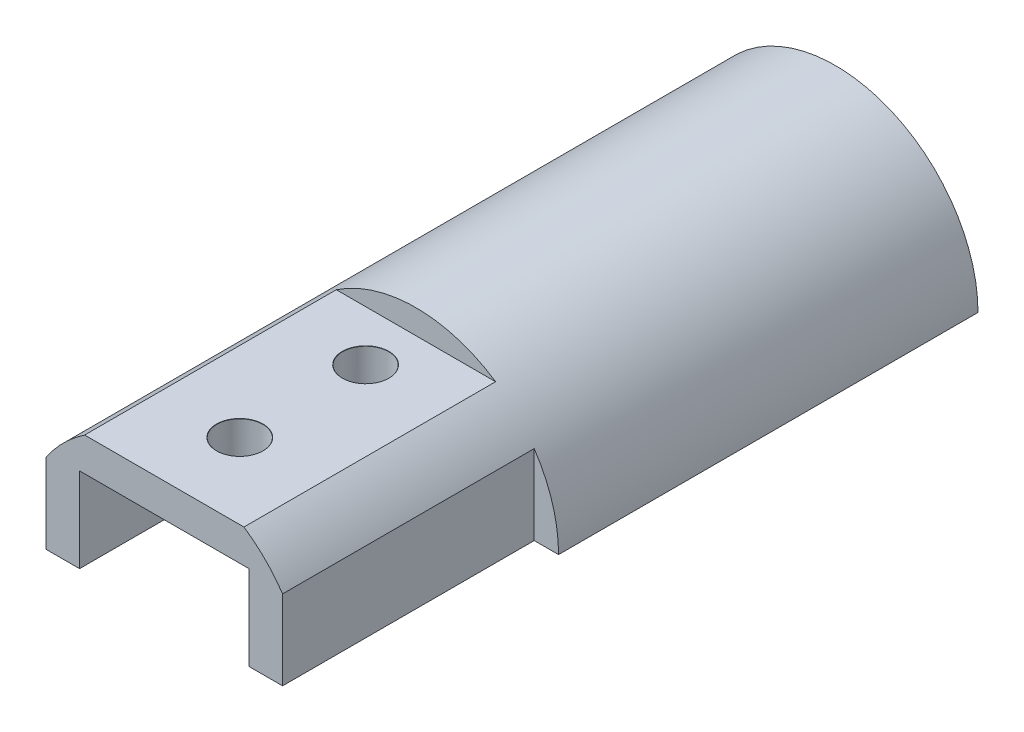
ISO-10303-21;
HEADER;
FILE_DESCRIPTION(('STEP AP214'),'2;1');
FILE_NAME('part.step','',(''),(''),'','','');
FILE_SCHEMA(('AUTOMOTIVE_DESIGN { 1 0 10303 214 1 1 1 1 }'));
ENDSEC;
DATA;
#1=APPLICATION_CONTEXT('core data for automotive mechanical design processes');
#2=APPLICATION_PROTOCOL_DEFINITION('international standard','automotive_design',2000,#1);
#3=PRODUCT_CONTEXT('',#1,'mechanical');
#4=PRODUCT('Part','Part','',(#3));
#5=PRODUCT_RELATED_PRODUCT_CATEGORY('part','',(#4));
#6=PRODUCT_DEFINITION_FORMATION('','',#4);
#7=PRODUCT_DEFINITION_CONTEXT('part definition',#1,'design');
#8=PRODUCT_DEFINITION('design','',#6,#7);
#9=PRODUCT_DEFINITION_SHAPE('','',#8);
#10=(LENGTH_UNIT() NAMED_UNIT(*) SI_UNIT(.MILLI.,.METRE.));
#11=(NAMED_UNIT(*) PLANE_ANGLE_UNIT() SI_UNIT($,.RADIAN.));
#12=(NAMED_UNIT(*) SI_UNIT($,.STERADIAN.) SOLID_ANGLE_UNIT());
#13=UNCERTAINTY_MEASURE_WITH_UNIT(LENGTH_MEASURE(1.E-05),#10,'distance_accuracy_value','');
#14=(GEOMETRIC_REPRESENTATION_CONTEXT(3) GLOBAL_UNCERTAINTY_ASSIGNED_CONTEXT((#13)) GLOBAL_UNIT_ASSIGNED_CONTEXT((#10,
#11,#12)) REPRESENTATION_CONTEXT('',''));
#15=CARTESIAN_POINT('',(0.,0.,0.));
#16=DIRECTION('',(0.,0.,1.));
#17=DIRECTION('',(1.,0.,0.));
#18=AXIS2_PLACEMENT_3D('',#15,#16,#17);
#19=CARTESIAN_POINT('',(0.,0.,50.));
#20=DIRECTION('',(0.,0.,1.));
#21=DIRECTION('',(1.,0.,0.));
#22=AXIS2_PLACEMENT_3D('',#19,#20,#21);
#23=PLANE('',#22);
#24=CARTESIAN_POINT('',(0.,0.,50.));
#25=DIRECTION('',(0.,0.,1.));
#26=DIRECTION('',(1.,0.,0.));
#27=AXIS2_PLACEMENT_3D('',#24,#25,#26);
#28=CIRCLE('',#27,17.);
#29=CARTESIAN_POINT('',(-14.1,9.49684158023077,50.));
#30=VERTEX_POINT('',#29);
#31=CARTESIAN_POINT('',(-17.,0.,50.));
#32=VERTEX_POINT('',#31);
#33=EDGE_CURVE('E381',#30,#32,#28,.T.);
#34=ORIENTED_EDGE('',*,*,#33,.T.);
#35=DIRECTION('',(1.,0.,0.));
#36=VECTOR('',#35,1.);
#37=CARTESIAN_POINT('',(0.,0.,50.));
#38=LINE('',#37,#36);
#39=CARTESIAN_POINT('',(-14.1,0.,50.));
#40=VERTEX_POINT('',#39);
#41=EDGE_CURVE('E508',#32,#40,#38,.T.);
#42=ORIENTED_EDGE('',*,*,#41,.T.);
#43=DIRECTION('',(0.,-1.,0.));
#44=VECTOR('',#43,1.);
#45=CARTESIAN_POINT('',(-14.1,0.,50.));
#46=LINE('',#45,#44);
#47=EDGE_CURVE('E304',#30,#40,#46,.T.);
#48=ORIENTED_EDGE('',*,*,#47,.F.);
#49=EDGE_LOOP('',(#34,#42,#48));
#50=FACE_BOUND('',#49,.T.);
#51=ADVANCED_FACE('F43',(#50),#23,.T.);
#52=CARTESIAN_POINT('',(0.,0.,3.));
#53=DIRECTION('',(0.,0.,-1.));
#54=DIRECTION('',(-1.,0.,0.));
#55=AXIS2_PLACEMENT_3D('',#52,#53,#54);
#56=CYLINDRICAL_SURFACE('',#55,17.);
#57=DIRECTION('',(0.,0.,-1.));
#58=VECTOR('',#57,1.);
#59=CARTESIAN_POINT('',(-17.,0.,3.));
#60=LINE('',#59,#58);
#61=CARTESIAN_POINT('',(-17.,0.,0.));
#62=VERTEX_POINT('',#61);
#63=EDGE_CURVE('E527',#32,#62,#60,.T.);
#64=ORIENTED_EDGE('',*,*,#63,.F.);
#65=ORIENTED_EDGE('',*,*,#33,.F.);
#66=DIRECTION('',(0.,0.,-1.));
#67=VECTOR('',#66,1.);
#68=CARTESIAN_POINT('',(-14.1,9.49684158023077,80.));
#69=LINE('',#68,#67);
#70=CARTESIAN_POINT('',(-14.1,9.49684158023077,80.));
#71=VERTEX_POINT('',#70);
#72=EDGE_CURVE('E336',#71,#30,#69,.T.);
#73=ORIENTED_EDGE('',*,*,#72,.F.);
#74=CARTESIAN_POINT('',(0.,0.,80.));
#75=DIRECTION('',(0.,0.,1.));
#76=DIRECTION('',(1.,0.,0.));
#77=AXIS2_PLACEMENT_3D('',#74,#75,#76);
#78=CIRCLE('',#77,17.);
#79=CARTESIAN_POINT('',(-9.49684158023077,14.1,80.));
#80=VERTEX_POINT('',#79);
#81=EDGE_CURVE('E310',#80,#71,#78,.T.);
#82=ORIENTED_EDGE('',*,*,#81,.F.);
#83=DIRECTION('',(0.,0.,-1.));
#84=VECTOR('',#83,1.);
#85=CARTESIAN_POINT('',(-9.49684158023077,14.1,80.));
#86=LINE('',#85,#84);
#87=CARTESIAN_POINT('',(-9.49684158023077,14.1,50.));
#88=VERTEX_POINT('',#87);
#89=EDGE_CURVE('E338',#80,#88,#86,.T.);
#90=ORIENTED_EDGE('',*,*,#89,.T.);
#91=CARTESIAN_POINT('',(9.49684158023077,14.1,50.));
#92=VERTEX_POINT('',#91);
#93=EDGE_CURVE('E382',#92,#88,#28,.T.);
#94=ORIENTED_EDGE('',*,*,#93,.F.);
#95=DIRECTION('',(0.,0.,-1.));
#96=VECTOR('',#95,1.);
#97=CARTESIAN_POINT('',(9.49684158023077,14.1,80.));
#98=LINE('',#97,#96);
#99=CARTESIAN_POINT('',(9.49684158023077,14.1,80.));
#100=VERTEX_POINT('',#99);
#101=EDGE_CURVE('E341',#100,#92,#98,.T.);
#102=ORIENTED_EDGE('',*,*,#101,.F.);
#103=CARTESIAN_POINT('',(14.1,9.49684158023076,80.));
#104=VERTEX_POINT('',#103);
#105=EDGE_CURVE('E314',#104,#100,#78,.T.);
#106=ORIENTED_EDGE('',*,*,#105,.F.);
#107=DIRECTION('',(0.,0.,-1.));
#108=VECTOR('',#107,1.);
#109=CARTESIAN_POINT('',(14.1,9.49684158023076,80.));
#110=LINE('',#109,#108);
#111=CARTESIAN_POINT('',(14.1,9.49684158023076,50.));
#112=VERTEX_POINT('',#111);
#113=EDGE_CURVE('E343',#104,#112,#110,.T.);
#114=ORIENTED_EDGE('',*,*,#113,.T.);
#115=CARTESIAN_POINT('',(17.,0.,50.));
#116=VERTEX_POINT('',#115);
#117=EDGE_CURVE('E379',#116,#112,#28,.T.);
#118=ORIENTED_EDGE('',*,*,#117,.F.);
#119=DIRECTION('',(0.,0.,-1.));
#120=VECTOR('',#119,1.);
#121=CARTESIAN_POINT('',(17.,0.,3.));
#122=LINE('',#121,#120);
#123=CARTESIAN_POINT('',(17.,0.,0.));
#124=VERTEX_POINT('',#123);
#125=EDGE_CURVE('E513',#124,#116,#122,.F.);
#126=ORIENTED_EDGE('',*,*,#125,.F.);
#127=CARTESIAN_POINT('',(0.,0.,0.));
#128=DIRECTION('',(0.,0.,1.));
#129=DIRECTION('',(1.,0.,0.));
#130=AXIS2_PLACEMENT_3D('',#127,#128,#129);
#131=CIRCLE('',#130,17.);
#132=EDGE_CURVE('E386',#124,#62,#131,.T.);
#133=ORIENTED_EDGE('',*,*,#132,.T.);
#134=EDGE_LOOP('',(#64,#65,#73,#82,#90,#94,#102,#106,#114,#118,#126,#133));
#135=FACE_BOUND('',#134,.T.);
#136=ADVANCED_FACE('F45',(#135),#56,.T.);
#137=CARTESIAN_POINT('',(0.,0.,0.));
#138=DIRECTION('',(0.,0.,1.));
#139=DIRECTION('',(1.,0.,0.));
#140=AXIS2_PLACEMENT_3D('',#137,#138,#139);
#141=PLANE('',#140);
#142=CARTESIAN_POINT('',(7.77817459305212,7.77817459305193,0.));
#143=DIRECTION('',(0.,0.,1.));
#144=DIRECTION('',(1.,0.,0.));
#145=AXIS2_PLACEMENT_3D('',#142,#143,#144);
#146=CIRCLE('',#145,1.45);
#147=CARTESIAN_POINT('',(9.22817459305212,7.77817459305193,0.));
#148=VERTEX_POINT('',#147);
#149=EDGE_CURVE('E283',#148,#148,#146,.T.);
#150=ORIENTED_EDGE('',*,*,#149,.T.);
#151=EDGE_LOOP('',(#150));
#152=FACE_BOUND('',#151,.T.);
#153=CARTESIAN_POINT('',(1.15218884181823E-13,11.,0.));
#154=DIRECTION('',(0.,0.,1.));
#155=DIRECTION('',(1.,0.,0.));
#156=AXIS2_PLACEMENT_3D('',#153,#154,#155);
#157=CIRCLE('',#156,1.45);
#158=CARTESIAN_POINT('',(1.45000000000011,11.,0.));
#159=VERTEX_POINT('',#158);
#160=EDGE_CURVE('E274',#159,#159,#157,.T.);
#161=ORIENTED_EDGE('',*,*,#160,.T.);
#162=EDGE_LOOP('',(#161));
#163=FACE_BOUND('',#162,.T.);
#164=CARTESIAN_POINT('',(-7.77817459305195,7.77817459305209,0.));
#165=DIRECTION('',(0.,0.,1.));
#166=DIRECTION('',(1.,0.,0.));
#167=AXIS2_PLACEMENT_3D('',#164,#165,#166);
#168=CIRCLE('',#167,1.45);
#169=CARTESIAN_POINT('',(-6.32817459305196,7.77817459305209,0.));
#170=VERTEX_POINT('',#169);
#171=EDGE_CURVE('E265',#170,#170,#168,.T.);
#172=ORIENTED_EDGE('',*,*,#171,.T.);
#173=EDGE_LOOP('',(#172));
#174=FACE_BOUND('',#173,.T.);
#175=DIRECTION('',(1.,0.,0.));
#176=VECTOR('',#175,1.);
#177=CARTESIAN_POINT('',(0.,0.,0.));
#178=LINE('',#177,#176);
#179=CARTESIAN_POINT('',(-12.45,0.,0.));
#180=VERTEX_POINT('',#179);
#181=EDGE_CURVE('E525',#62,#180,#178,.T.);
#182=ORIENTED_EDGE('',*,*,#181,.F.);
#183=ORIENTED_EDGE('',*,*,#132,.F.);
#184=CARTESIAN_POINT('',(12.45,0.,0.));
#185=VERTEX_POINT('',#184);
#186=EDGE_CURVE('E514',#185,#124,#178,.T.);
#187=ORIENTED_EDGE('',*,*,#186,.F.);
#188=CARTESIAN_POINT('',(11.,0.,0.));
#189=DIRECTION('',(0.,0.,1.));
#190=DIRECTION('',(1.,0.,0.));
#191=AXIS2_PLACEMENT_3D('',#188,#189,#190);
#192=CIRCLE('',#191,1.45);
#193=CARTESIAN_POINT('',(9.55,0.,0.));
#194=VERTEX_POINT('',#193);
#195=EDGE_CURVE('E242',#185,#194,#192,.T.);
#196=ORIENTED_EDGE('',*,*,#195,.T.);
#197=CARTESIAN_POINT('',(5.,0.,0.));
#198=VERTEX_POINT('',#197);
#199=EDGE_CURVE('E234',#198,#194,#178,.T.);
#200=ORIENTED_EDGE('',*,*,#199,.F.);
#201=CARTESIAN_POINT('',(0.,0.,0.));
#202=DIRECTION('',(0.,0.,1.));
#203=DIRECTION('',(1.,0.,0.));
#204=AXIS2_PLACEMENT_3D('',#201,#202,#203);
#205=CIRCLE('',#204,5.);
#206=CARTESIAN_POINT('',(-5.,0.,0.));
#207=VERTEX_POINT('',#206);
#208=EDGE_CURVE('E383',#198,#207,#205,.T.);
#209=ORIENTED_EDGE('',*,*,#208,.T.);
#210=CARTESIAN_POINT('',(-9.55,0.,0.));
#211=VERTEX_POINT('',#210);
#212=EDGE_CURVE('E244',#211,#207,#178,.T.);
#213=ORIENTED_EDGE('',*,*,#212,.F.);
#214=CARTESIAN_POINT('',(-11.,0.,0.));
#215=DIRECTION('',(0.,0.,1.));
#216=DIRECTION('',(1.,0.,0.));
#217=AXIS2_PLACEMENT_3D('',#214,#215,#216);
#218=CIRCLE('',#217,1.45);
#219=EDGE_CURVE('E256',#211,#180,#218,.T.);
#220=ORIENTED_EDGE('',*,*,#219,.T.);
#221=EDGE_LOOP('',(#182,#183,#187,#196,#200,#209,#213,#220));
#222=FACE_BOUND('',#221,.T.);
#223=ADVANCED_FACE('F466',(#152,#163,#174,#222),#141,.F.);
#224=CARTESIAN_POINT('',(0.,0.,43.));
#225=DIRECTION('',(0.,0.,-1.));
#226=DIRECTION('',(-1.,0.,0.));
#227=AXIS2_PLACEMENT_3D('',#224,#225,#226);
#228=CYLINDRICAL_SURFACE('',#227,15.);
#229=CARTESIAN_POINT('',(0.,0.,43.));
#230=DIRECTION('',(0.,0.,1.));
#231=DIRECTION('',(1.,0.,0.));
#232=AXIS2_PLACEMENT_3D('',#229,#230,#231);
#233=CIRCLE('',#232,15.);
#234=CARTESIAN_POINT('',(15.,0.,43.));
#235=VERTEX_POINT('',#234);
#236=CARTESIAN_POINT('',(-15.,0.,43.));
#237=VERTEX_POINT('',#236);
#238=EDGE_CURVE('E388',#235,#237,#233,.T.);
#239=ORIENTED_EDGE('',*,*,#238,.T.);
#240=DIRECTION('',(0.,0.,-1.));
#241=VECTOR('',#240,1.);
#242=CARTESIAN_POINT('',(-15.,0.,43.));
#243=LINE('',#242,#241);
#244=CARTESIAN_POINT('',(-15.,0.,3.));
#245=VERTEX_POINT('',#244);
#246=EDGE_CURVE('E528',#237,#245,#243,.T.);
#247=ORIENTED_EDGE('',*,*,#246,.T.);
#248=CARTESIAN_POINT('',(0.,0.,3.));
#249=DIRECTION('',(0.,0.,1.));
#250=DIRECTION('',(1.,0.,0.));
#251=AXIS2_PLACEMENT_3D('',#248,#249,#250);
#252=CIRCLE('',#251,15.);
#253=CARTESIAN_POINT('',(15.,0.,3.));
#254=VERTEX_POINT('',#253);
#255=EDGE_CURVE('E393',#245,#254,#252,.F.);
#256=ORIENTED_EDGE('',*,*,#255,.T.);
#257=DIRECTION('',(0.,0.,-1.));
#258=VECTOR('',#257,1.);
#259=CARTESIAN_POINT('',(15.,0.,43.));
#260=LINE('',#259,#258);
#261=EDGE_CURVE('E517',#254,#235,#260,.F.);
#262=ORIENTED_EDGE('',*,*,#261,.T.);
#263=EDGE_LOOP('',(#239,#247,#256,#262));
#264=FACE_BOUND('',#263,.T.);
#265=ADVANCED_FACE('F554',(#264),#228,.F.);
#266=CARTESIAN_POINT('',(0.,0.,3.));
#267=DIRECTION('',(0.,0.,1.));
#268=DIRECTION('',(1.,0.,0.));
#269=AXIS2_PLACEMENT_3D('',#266,#267,#268);
#270=PLANE('',#269);
#271=CARTESIAN_POINT('',(7.77817459305212,7.77817459305193,3.));
#272=DIRECTION('',(0.,0.,1.));
#273=DIRECTION('',(1.,0.,0.));
#274=AXIS2_PLACEMENT_3D('',#271,#272,#273);
#275=CIRCLE('',#274,1.475);
#276=CARTESIAN_POINT('',(9.25317459305212,7.77817459305193,3.));
#277=VERTEX_POINT('',#276);
#278=EDGE_CURVE('E277',#277,#277,#275,.T.);
#279=ORIENTED_EDGE('',*,*,#278,.F.);
#280=EDGE_LOOP('',(#279));
#281=FACE_BOUND('',#280,.T.);
#282=CARTESIAN_POINT('',(1.15218884181823E-13,11.,3.));
#283=DIRECTION('',(0.,0.,1.));
#284=DIRECTION('',(1.,0.,0.));
#285=AXIS2_PLACEMENT_3D('',#282,#283,#284);
#286=CIRCLE('',#285,1.475);
#287=CARTESIAN_POINT('',(1.47500000000012,11.,3.));
#288=VERTEX_POINT('',#287);
#289=EDGE_CURVE('E268',#288,#288,#286,.T.);
#290=ORIENTED_EDGE('',*,*,#289,.F.);
#291=EDGE_LOOP('',(#290));
#292=FACE_BOUND('',#291,.T.);
#293=CARTESIAN_POINT('',(-7.77817459305195,7.77817459305209,3.));
#294=DIRECTION('',(0.,0.,1.));
#295=DIRECTION('',(1.,0.,0.));
#296=AXIS2_PLACEMENT_3D('',#293,#294,#295);
#297=CIRCLE('',#296,1.475);
#298=CARTESIAN_POINT('',(-6.30317459305195,7.77817459305209,3.));
#299=VERTEX_POINT('',#298);
#300=EDGE_CURVE('E259',#299,#299,#297,.T.);
#301=ORIENTED_EDGE('',*,*,#300,.F.);
#302=EDGE_LOOP('',(#301));
#303=FACE_BOUND('',#302,.T.);
#304=ORIENTED_EDGE('',*,*,#255,.F.);
#305=DIRECTION('',(1.,0.,0.));
#306=VECTOR('',#305,1.);
#307=CARTESIAN_POINT('',(0.,0.,3.));
#308=LINE('',#307,#306);
#309=CARTESIAN_POINT('',(-12.475,0.,3.));
#310=VERTEX_POINT('',#309);
#311=EDGE_CURVE('E532',#245,#310,#308,.T.);
#312=ORIENTED_EDGE('',*,*,#311,.T.);
#313=CARTESIAN_POINT('',(-11.,0.,3.));
#314=DIRECTION('',(0.,0.,1.));
#315=DIRECTION('',(1.,0.,0.));
#316=AXIS2_PLACEMENT_3D('',#313,#314,#315);
#317=CIRCLE('',#316,1.475);
#318=CARTESIAN_POINT('',(-9.525,0.,3.));
#319=VERTEX_POINT('',#318);
#320=EDGE_CURVE('E250',#319,#310,#317,.T.);
#321=ORIENTED_EDGE('',*,*,#320,.F.);
#322=CARTESIAN_POINT('',(-5.,0.,3.));
#323=VERTEX_POINT('',#322);
#324=EDGE_CURVE('E58',#319,#323,#308,.T.);
#325=ORIENTED_EDGE('',*,*,#324,.T.);
#326=CARTESIAN_POINT('',(0.,0.,3.));
#327=DIRECTION('',(0.,0.,1.));
#328=DIRECTION('',(1.,0.,0.));
#329=AXIS2_PLACEMENT_3D('',#326,#327,#328);
#330=CIRCLE('',#329,5.);
#331=CARTESIAN_POINT('',(5.,0.,3.));
#332=VERTEX_POINT('',#331);
#333=EDGE_CURVE('E233',#332,#323,#330,.T.);
#334=ORIENTED_EDGE('',*,*,#333,.F.);
#335=CARTESIAN_POINT('',(9.525,0.,3.));
#336=VERTEX_POINT('',#335);
#337=EDGE_CURVE('E216',#332,#336,#308,.T.);
#338=ORIENTED_EDGE('',*,*,#337,.T.);
#339=CARTESIAN_POINT('',(11.,0.,3.));
#340=DIRECTION('',(0.,0.,1.));
#341=DIRECTION('',(1.,0.,0.));
#342=AXIS2_PLACEMENT_3D('',#339,#340,#341);
#343=CIRCLE('',#342,1.475);
#344=CARTESIAN_POINT('',(12.475,0.,3.));
#345=VERTEX_POINT('',#344);
#346=EDGE_CURVE('E231',#345,#336,#343,.T.);
#347=ORIENTED_EDGE('',*,*,#346,.F.);
#348=EDGE_CURVE('E236',#345,#254,#308,.T.);
#349=ORIENTED_EDGE('',*,*,#348,.T.);
#350=EDGE_LOOP('',(#304,#312,#321,#325,#334,#338,#347,#349));
#351=FACE_BOUND('',#350,.T.);
#352=ADVANCED_FACE('F229',(#281,#292,#303,#351),#270,.T.);
#353=CARTESIAN_POINT('',(0.,0.,0.));
#354=DIRECTION('',(0.,0.,1.));
#355=DIRECTION('',(1.,0.,0.));
#356=AXIS2_PLACEMENT_3D('',#353,#354,#355);
#357=CYLINDRICAL_SURFACE('',#356,5.);
#358=DIRECTION('',(0.,0.,1.));
#359=VECTOR('',#358,1.);
#360=CARTESIAN_POINT('',(5.,0.,0.));
#361=LINE('',#360,#359);
#362=EDGE_CURVE('E521',#332,#198,#361,.F.);
#363=ORIENTED_EDGE('',*,*,#362,.F.);
#364=ORIENTED_EDGE('',*,*,#333,.T.);
#365=DIRECTION('',(0.,0.,1.));
#366=VECTOR('',#365,1.);
#367=CARTESIAN_POINT('',(-5.,0.,0.));
#368=LINE('',#367,#366);
#369=EDGE_CURVE('E240',#207,#323,#368,.T.);
#370=ORIENTED_EDGE('',*,*,#369,.F.);
#371=ORIENTED_EDGE('',*,*,#208,.F.);
#372=EDGE_LOOP('',(#363,#364,#370,#371));
#373=FACE_BOUND('',#372,.T.);
#374=ADVANCED_FACE('F477',(#373),#357,.F.);
#375=CARTESIAN_POINT('',(0.,0.,43.));
#376=DIRECTION('',(0.,0.,1.));
#377=DIRECTION('',(1.,0.,0.));
#378=AXIS2_PLACEMENT_3D('',#375,#376,#377);
#379=PLANE('',#378);
#380=DIRECTION('',(1.,0.,0.));
#381=VECTOR('',#380,1.);
#382=CARTESIAN_POINT('',(0.,0.,43.));
#383=LINE('',#382,#381);
#384=CARTESIAN_POINT('',(-10.1,0.,43.));
#385=VERTEX_POINT('',#384);
#386=EDGE_CURVE('E502',#237,#385,#383,.T.);
#387=ORIENTED_EDGE('',*,*,#386,.F.);
#388=ORIENTED_EDGE('',*,*,#238,.F.);
#389=CARTESIAN_POINT('',(10.1,0.,43.));
#390=VERTEX_POINT('',#389);
#391=EDGE_CURVE('E507',#390,#235,#383,.T.);
#392=ORIENTED_EDGE('',*,*,#391,.F.);
#393=DIRECTION('',(0.,1.,0.));
#394=VECTOR('',#393,1.);
#395=CARTESIAN_POINT('',(10.1,4.44314575050765,43.));
#396=LINE('',#395,#394);
#397=CARTESIAN_POINT('',(10.1,4.44314575050765,43.));
#398=VERTEX_POINT('',#397);
#399=EDGE_CURVE('E362',#390,#398,#396,.T.);
#400=ORIENTED_EDGE('',*,*,#399,.T.);
#401=DIRECTION('',(-0.707106781186551,0.707106781186544,0.));
#402=VECTOR('',#401,1.);
#403=CARTESIAN_POINT('',(4.44314575050759,10.1,43.));
#404=LINE('',#403,#402);
#405=CARTESIAN_POINT('',(4.44314575050759,10.1,43.));
#406=VERTEX_POINT('',#405);
#407=EDGE_CURVE('E364',#398,#406,#404,.T.);
#408=ORIENTED_EDGE('',*,*,#407,.T.);
#409=DIRECTION('',(-1.,0.,0.));
#410=VECTOR('',#409,1.);
#411=CARTESIAN_POINT('',(-4.44314575050759,10.1,43.));
#412=LINE('',#411,#410);
#413=CARTESIAN_POINT('',(-4.44314575050759,10.1,43.));
#414=VERTEX_POINT('',#413);
#415=EDGE_CURVE('E353',#406,#414,#412,.T.);
#416=ORIENTED_EDGE('',*,*,#415,.T.);
#417=DIRECTION('',(-0.707106781186551,-0.707106781186544,0.));
#418=VECTOR('',#417,1.);
#419=CARTESIAN_POINT('',(-4.44314575050759,10.1,43.));
#420=LINE('',#419,#418);
#421=CARTESIAN_POINT('',(-10.1,4.44314575050765,43.));
#422=VERTEX_POINT('',#421);
#423=EDGE_CURVE('E346',#414,#422,#420,.T.);
#424=ORIENTED_EDGE('',*,*,#423,.T.);
#425=DIRECTION('',(0.,-1.,0.));
#426=VECTOR('',#425,1.);
#427=CARTESIAN_POINT('',(-10.1,4.44314575050765,43.));
#428=LINE('',#427,#426);
#429=EDGE_CURVE('E359',#422,#385,#428,.T.);
#430=ORIENTED_EDGE('',*,*,#429,.T.);
#431=EDGE_LOOP('',(#387,#388,#392,#400,#408,#416,#424,#430));
#432=FACE_BOUND('',#431,.T.);
#433=ADVANCED_FACE('F419',(#432),#379,.F.);
#434=DIRECTION('',(0.,1.,0.));
#435=VECTOR('',#434,1.);
#436=CARTESIAN_POINT('',(14.1,0.,50.));
#437=LINE('',#436,#435);
#438=CARTESIAN_POINT('',(14.1,0.,50.));
#439=VERTEX_POINT('',#438);
#440=EDGE_CURVE('E325',#439,#112,#437,.T.);
#441=ORIENTED_EDGE('',*,*,#440,.F.);
#442=DIRECTION('',(1.,0.,0.));
#443=VECTOR('',#442,1.);
#444=CARTESIAN_POINT('',(0.,0.,50.));
#445=LINE('',#444,#443);
#446=EDGE_CURVE('E480',#439,#116,#445,.T.);
#447=ORIENTED_EDGE('',*,*,#446,.T.);
#448=ORIENTED_EDGE('',*,*,#117,.T.);
#449=EDGE_LOOP('',(#441,#447,#448));
#450=FACE_BOUND('',#449,.T.);
#451=ADVANCED_FACE('F457',(#450),#23,.T.);
#452=CARTESIAN_POINT('',(-10.1,4.44314575050765,50.));
#453=DIRECTION('',(1.,0.,0.));
#454=DIRECTION('',(0.,0.,-1.));
#455=AXIS2_PLACEMENT_3D('',#452,#453,#454);
#456=PLANE('',#455);
#457=DIRECTION('',(0.,-1.,0.));
#458=VECTOR('',#457,1.);
#459=CARTESIAN_POINT('',(-10.1,0.,80.));
#460=LINE('',#459,#458);
#461=CARTESIAN_POINT('',(-10.1,10.1,80.));
#462=VERTEX_POINT('',#461);
#463=CARTESIAN_POINT('',(-10.1,0.,80.));
#464=VERTEX_POINT('',#463);
#465=EDGE_CURVE('E300',#462,#464,#460,.T.);
#466=ORIENTED_EDGE('',*,*,#465,.T.);
#467=DIRECTION('',(0.,0.,-1.));
#468=VECTOR('',#467,1.);
#469=CARTESIAN_POINT('',(-10.1,0.,50.));
#470=LINE('',#469,#468);
#471=EDGE_CURVE('E440',#464,#385,#470,.T.);
#472=ORIENTED_EDGE('',*,*,#471,.T.);
#473=ORIENTED_EDGE('',*,*,#429,.F.);
#474=DIRECTION('',(0.,0.,-1.));
#475=VECTOR('',#474,1.);
#476=CARTESIAN_POINT('',(-10.1,4.44314575050765,50.));
#477=LINE('',#476,#475);
#478=CARTESIAN_POINT('',(-10.1,4.44314575050765,50.));
#479=VERTEX_POINT('',#478);
#480=EDGE_CURVE('E376',#479,#422,#477,.T.);
#481=ORIENTED_EDGE('',*,*,#480,.F.);
#482=DIRECTION('',(0.,-1.,0.));
#483=VECTOR('',#482,1.);
#484=CARTESIAN_POINT('',(-10.1,0.,50.));
#485=LINE('',#484,#483);
#486=CARTESIAN_POINT('',(-10.1,10.1,50.));
#487=VERTEX_POINT('',#486);
#488=EDGE_CURVE('E321',#487,#479,#485,.T.);
#489=ORIENTED_EDGE('',*,*,#488,.F.);
#490=DIRECTION('',(0.,0.,-1.));
#491=VECTOR('',#490,1.);
#492=CARTESIAN_POINT('',(-10.1,10.1,80.));
#493=LINE('',#492,#491);
#494=EDGE_CURVE('E339',#462,#487,#493,.T.);
#495=ORIENTED_EDGE('',*,*,#494,.F.);
#496=EDGE_LOOP('',(#466,#472,#473,#481,#489,#495));
#497=FACE_BOUND('',#496,.T.);
#498=ADVANCED_FACE('F439',(#497),#456,.T.);
#499=CARTESIAN_POINT('',(10.1,4.44314575050765,50.));
#500=DIRECTION('',(-1.,0.,0.));
#501=DIRECTION('',(0.,0.,1.));
#502=AXIS2_PLACEMENT_3D('',#499,#500,#501);
#503=PLANE('',#502);
#504=ORIENTED_EDGE('',*,*,#399,.F.);
#505=DIRECTION('',(0.,0.,1.));
#506=VECTOR('',#505,1.);
#507=CARTESIAN_POINT('',(10.1,0.,50.));
#508=LINE('',#507,#506);
#509=CARTESIAN_POINT('',(10.1,0.,80.));
#510=VERTEX_POINT('',#509);
#511=EDGE_CURVE('E498',#390,#510,#508,.T.);
#512=ORIENTED_EDGE('',*,*,#511,.T.);
#513=DIRECTION('',(0.,1.,0.));
#514=VECTOR('',#513,1.);
#515=CARTESIAN_POINT('',(10.1,0.,80.));
#516=LINE('',#515,#514);
#517=CARTESIAN_POINT('',(10.1,10.1,80.));
#518=VERTEX_POINT('',#517);
#519=EDGE_CURVE('E307',#510,#518,#516,.T.);
#520=ORIENTED_EDGE('',*,*,#519,.T.);
#521=DIRECTION('',(0.,0.,-1.));
#522=VECTOR('',#521,1.);
#523=CARTESIAN_POINT('',(10.1,10.1,80.));
#524=LINE('',#523,#522);
#525=CARTESIAN_POINT('',(10.1,10.1,50.));
#526=VERTEX_POINT('',#525);
#527=EDGE_CURVE('E320',#518,#526,#524,.T.);
#528=ORIENTED_EDGE('',*,*,#527,.T.);
#529=DIRECTION('',(0.,1.,0.));
#530=VECTOR('',#529,1.);
#531=CARTESIAN_POINT('',(10.1,0.,50.));
#532=LINE('',#531,#530);
#533=CARTESIAN_POINT('',(10.1,4.44314575050765,50.));
#534=VERTEX_POINT('',#533);
#535=EDGE_CURVE('E224',#534,#526,#532,.T.);
#536=ORIENTED_EDGE('',*,*,#535,.F.);
#537=DIRECTION('',(0.,0.,-1.));
#538=VECTOR('',#537,1.);
#539=CARTESIAN_POINT('',(10.1,4.44314575050765,50.));
#540=LINE('',#539,#538);
#541=EDGE_CURVE('E373',#534,#398,#540,.T.);
#542=ORIENTED_EDGE('',*,*,#541,.T.);
#543=EDGE_LOOP('',(#504,#512,#520,#528,#536,#542));
#544=FACE_BOUND('',#543,.T.);
#545=ADVANCED_FACE('F475',(#544),#503,.T.);
#546=CARTESIAN_POINT('',(14.1,0.,80.));
#547=DIRECTION('',(-1.,0.,0.));
#548=DIRECTION('',(0.,-1.,0.));
#549=AXIS2_PLACEMENT_3D('',#546,#547,#548);
#550=PLANE('',#549);
#551=DIRECTION('',(0.,0.,1.));
#552=VECTOR('',#551,1.);
#553=CARTESIAN_POINT('',(14.1,0.,80.));
#554=LINE('',#553,#552);
#555=CARTESIAN_POINT('',(14.1,0.,80.));
#556=VERTEX_POINT('',#555);
#557=EDGE_CURVE('E488',#439,#556,#554,.T.);
#558=ORIENTED_EDGE('',*,*,#557,.F.);
#559=ORIENTED_EDGE('',*,*,#440,.T.);
#560=ORIENTED_EDGE('',*,*,#113,.F.);
#561=DIRECTION('',(0.,1.,0.));
#562=VECTOR('',#561,1.);
#563=CARTESIAN_POINT('',(14.1,0.,80.));
#564=LINE('',#563,#562);
#565=EDGE_CURVE('E309',#556,#104,#564,.T.);
#566=ORIENTED_EDGE('',*,*,#565,.F.);
#567=EDGE_LOOP('',(#558,#559,#560,#566));
#568=FACE_BOUND('',#567,.T.);
#569=ADVANCED_FACE('F485',(#568),#550,.F.);
#570=CARTESIAN_POINT('',(-14.1,0.,80.));
#571=DIRECTION('',(1.,0.,0.));
#572=DIRECTION('',(0.,1.,0.));
#573=AXIS2_PLACEMENT_3D('',#570,#571,#572);
#574=PLANE('',#573);
#575=DIRECTION('',(0.,0.,-1.));
#576=VECTOR('',#575,1.);
#577=CARTESIAN_POINT('',(-14.1,0.,80.));
#578=LINE('',#577,#576);
#579=CARTESIAN_POINT('',(-14.1,0.,80.));
#580=VERTEX_POINT('',#579);
#581=EDGE_CURVE('E505',#580,#40,#578,.T.);
#582=ORIENTED_EDGE('',*,*,#581,.F.);
#583=DIRECTION('',(0.,-1.,0.));
#584=VECTOR('',#583,1.);
#585=CARTESIAN_POINT('',(-14.1,0.,80.));
#586=LINE('',#585,#584);
#587=EDGE_CURVE('E312',#71,#580,#586,.T.);
#588=ORIENTED_EDGE('',*,*,#587,.F.);
#589=ORIENTED_EDGE('',*,*,#72,.T.);
#590=ORIENTED_EDGE('',*,*,#47,.T.);
#591=EDGE_LOOP('',(#582,#588,#589,#590));
#592=FACE_BOUND('',#591,.T.);
#593=ADVANCED_FACE('F561',(#592),#574,.F.);
#594=CARTESIAN_POINT('',(0.,0.,80.));
#595=DIRECTION('',(0.,0.,1.));
#596=DIRECTION('',(1.,0.,0.));
#597=AXIS2_PLACEMENT_3D('',#594,#595,#596);
#598=PLANE('',#597);
#599=ORIENTED_EDGE('',*,*,#587,.T.);
#600=DIRECTION('',(1.,0.,0.));
#601=VECTOR('',#600,1.);
#602=CARTESIAN_POINT('',(0.,0.,80.));
#603=LINE('',#602,#601);
#604=EDGE_CURVE('E436',#580,#464,#603,.T.);
#605=ORIENTED_EDGE('',*,*,#604,.T.);
#606=ORIENTED_EDGE('',*,*,#465,.F.);
#607=DIRECTION('',(-1.,0.,0.));
#608=VECTOR('',#607,1.);
#609=CARTESIAN_POINT('',(0.,10.1,80.));
#610=LINE('',#609,#608);
#611=EDGE_CURVE('E303',#518,#462,#610,.T.);
#612=ORIENTED_EDGE('',*,*,#611,.F.);
#613=ORIENTED_EDGE('',*,*,#519,.F.);
#614=EDGE_CURVE('E494',#510,#556,#603,.T.);
#615=ORIENTED_EDGE('',*,*,#614,.T.);
#616=ORIENTED_EDGE('',*,*,#565,.T.);
#617=ORIENTED_EDGE('',*,*,#105,.T.);
#618=DIRECTION('',(1.,0.,0.));
#619=VECTOR('',#618,1.);
#620=CARTESIAN_POINT('',(0.,14.1,80.));
#621=LINE('',#620,#619);
#622=EDGE_CURVE('E313',#80,#100,#621,.T.);
#623=ORIENTED_EDGE('',*,*,#622,.F.);
#624=ORIENTED_EDGE('',*,*,#81,.T.);
#625=EDGE_LOOP('',(#599,#605,#606,#612,#613,#615,#616,#617,#623,#624));
#626=FACE_BOUND('',#625,.T.);
#627=ADVANCED_FACE('F433',(#626),#598,.T.);
#628=CARTESIAN_POINT('',(-11.,0.,3.));
#629=DIRECTION('',(0.,0.,1.));
#630=DIRECTION('',(1.,0.,0.));
#631=AXIS2_PLACEMENT_3D('',#628,#629,#630);
#632=CYLINDRICAL_SURFACE('',#631,1.45);
#633=DIRECTION('',(0.,0.,1.));
#634=VECTOR('',#633,1.);
#635=CARTESIAN_POINT('',(-9.55,0.,3.));
#636=LINE('',#635,#634);
#637=CARTESIAN_POINT('',(-9.55,0.,2.975));
#638=VERTEX_POINT('',#637);
#639=EDGE_CURVE('E540',#638,#211,#636,.F.);
#640=ORIENTED_EDGE('',*,*,#639,.F.);
#641=CARTESIAN_POINT('',(-11.,0.,2.975));
#642=DIRECTION('',(0.,0.,1.));
#643=DIRECTION('',(1.,0.,0.));
#644=AXIS2_PLACEMENT_3D('',#641,#642,#643);
#645=CIRCLE('',#644,1.45);
#646=CARTESIAN_POINT('',(-12.45,0.,2.975));
#647=VERTEX_POINT('',#646);
#648=EDGE_CURVE('E253',#638,#647,#645,.T.);
#649=ORIENTED_EDGE('',*,*,#648,.T.);
#650=DIRECTION('',(0.,0.,1.));
#651=VECTOR('',#650,1.);
#652=CARTESIAN_POINT('',(-12.45,0.,3.));
#653=LINE('',#652,#651);
#654=EDGE_CURVE('E66',#180,#647,#653,.T.);
#655=ORIENTED_EDGE('',*,*,#654,.F.);
#656=ORIENTED_EDGE('',*,*,#219,.F.);
#657=EDGE_LOOP('',(#640,#649,#655,#656));
#658=FACE_BOUND('',#657,.T.);
#659=ADVANCED_FACE('F696',(#658),#632,.F.);
#660=CARTESIAN_POINT('',(-11.,0.,3.));
#661=DIRECTION('',(0.,0.,1.));
#662=DIRECTION('',(1.,0.,0.));
#663=AXIS2_PLACEMENT_3D('',#660,#661,#662);
#664=CONICAL_SURFACE('',#663,1.475,0.785398163397466);
#665=DIRECTION('',(0.70710678118656,0.,0.707106781186535));
#666=VECTOR('',#665,1.);
#667=CARTESIAN_POINT('',(-11.,0.,1.52500000000005));
#668=LINE('',#667,#666);
#669=EDGE_CURVE('E503',#319,#638,#668,.F.);
#670=ORIENTED_EDGE('',*,*,#669,.F.);
#671=ORIENTED_EDGE('',*,*,#320,.T.);
#672=DIRECTION('',(0.70710678118656,0.,-0.707106781186535));
#673=VECTOR('',#672,1.);
#674=CARTESIAN_POINT('',(-11.,0.,1.52500000000005));
#675=LINE('',#674,#673);
#676=EDGE_CURVE('E497',#647,#310,#675,.F.);
#677=ORIENTED_EDGE('',*,*,#676,.F.);
#678=ORIENTED_EDGE('',*,*,#648,.F.);
#679=EDGE_LOOP('',(#670,#671,#677,#678));
#680=FACE_BOUND('',#679,.T.);
#681=ADVANCED_FACE('F688',(#680),#664,.F.);
#682=CARTESIAN_POINT('',(11.,0.,3.));
#683=DIRECTION('',(0.,0.,1.));
#684=DIRECTION('',(1.,0.,0.));
#685=AXIS2_PLACEMENT_3D('',#682,#683,#684);
#686=CYLINDRICAL_SURFACE('',#685,1.45);
#687=DIRECTION('',(0.,0.,1.));
#688=VECTOR('',#687,1.);
#689=CARTESIAN_POINT('',(12.45,0.,3.));
#690=LINE('',#689,#688);
#691=CARTESIAN_POINT('',(12.45,0.,2.975));
#692=VERTEX_POINT('',#691);
#693=EDGE_CURVE('E519',#692,#185,#690,.F.);
#694=ORIENTED_EDGE('',*,*,#693,.F.);
#695=CARTESIAN_POINT('',(11.,0.,2.975));
#696=DIRECTION('',(0.,0.,1.));
#697=DIRECTION('',(1.,0.,0.));
#698=AXIS2_PLACEMENT_3D('',#695,#696,#697);
#699=CIRCLE('',#698,1.45);
#700=CARTESIAN_POINT('',(9.55,0.,2.975));
#701=VERTEX_POINT('',#700);
#702=EDGE_CURVE('E239',#692,#701,#699,.T.);
#703=ORIENTED_EDGE('',*,*,#702,.T.);
#704=DIRECTION('',(0.,0.,1.));
#705=VECTOR('',#704,1.);
#706=CARTESIAN_POINT('',(9.55,0.,3.));
#707=LINE('',#706,#705);
#708=EDGE_CURVE('E219',#194,#701,#707,.T.);
#709=ORIENTED_EDGE('',*,*,#708,.F.);
#710=ORIENTED_EDGE('',*,*,#195,.F.);
#711=EDGE_LOOP('',(#694,#703,#709,#710));
#712=FACE_BOUND('',#711,.T.);
#713=ADVANCED_FACE('F552',(#712),#686,.F.);
#714=CARTESIAN_POINT('',(11.,0.,3.));
#715=DIRECTION('',(0.,0.,1.));
#716=DIRECTION('',(1.,0.,0.));
#717=AXIS2_PLACEMENT_3D('',#714,#715,#716);
#718=CONICAL_SURFACE('',#717,1.475,0.785398163397466);
#719=DIRECTION('',(0.70710678118656,0.,0.707106781186535));
#720=VECTOR('',#719,1.);
#721=CARTESIAN_POINT('',(11.,0.,1.52500000000005));
#722=LINE('',#721,#720);
#723=EDGE_CURVE('E11',#345,#692,#722,.F.);
#724=ORIENTED_EDGE('',*,*,#723,.F.);
#725=ORIENTED_EDGE('',*,*,#346,.T.);
#726=DIRECTION('',(0.70710678118656,0.,-0.707106781186535));
#727=VECTOR('',#726,1.);
#728=CARTESIAN_POINT('',(11.,0.,1.52500000000005));
#729=LINE('',#728,#727);
#730=EDGE_CURVE('E51',#701,#336,#729,.F.);
#731=ORIENTED_EDGE('',*,*,#730,.F.);
#732=ORIENTED_EDGE('',*,*,#702,.F.);
#733=EDGE_LOOP('',(#724,#725,#731,#732));
#734=FACE_BOUND('',#733,.T.);
#735=ADVANCED_FACE('F238',(#734),#718,.F.);
#736=DIRECTION('',(-0.707106781186551,0.707106781186544,0.));
#737=VECTOR('',#736,1.);
#738=CARTESIAN_POINT('',(4.44314575050759,10.1,50.));
#739=LINE('',#738,#737);
#740=CARTESIAN_POINT('',(4.44314575050759,10.1,50.));
#741=VERTEX_POINT('',#740);
#742=EDGE_CURVE('E352',#534,#741,#739,.T.);
#743=ORIENTED_EDGE('',*,*,#742,.F.);
#744=ORIENTED_EDGE('',*,*,#535,.T.);
#745=DIRECTION('',(-1.,0.,0.));
#746=VECTOR('',#745,1.);
#747=CARTESIAN_POINT('',(0.,10.1,50.));
#748=LINE('',#747,#746);
#749=EDGE_CURVE('E323',#526,#741,#748,.T.);
#750=ORIENTED_EDGE('',*,*,#749,.T.);
#751=EDGE_LOOP('',(#743,#744,#750));
#752=FACE_BOUND('',#751,.T.);
#753=ADVANCED_FACE('F426',(#752),#23,.T.);
#754=DIRECTION('',(-0.707106781186551,-0.707106781186544,0.));
#755=VECTOR('',#754,1.);
#756=CARTESIAN_POINT('',(-4.44314575050759,10.1,50.));
#757=LINE('',#756,#755);
#758=CARTESIAN_POINT('',(-4.44314575050759,10.1,50.));
#759=VERTEX_POINT('',#758);
#760=EDGE_CURVE('E349',#759,#479,#757,.T.);
#761=ORIENTED_EDGE('',*,*,#760,.F.);
#762=EDGE_CURVE('E326',#759,#487,#748,.T.);
#763=ORIENTED_EDGE('',*,*,#762,.T.);
#764=ORIENTED_EDGE('',*,*,#488,.T.);
#765=EDGE_LOOP('',(#761,#763,#764));
#766=FACE_BOUND('',#765,.T.);
#767=ADVANCED_FACE('F448',(#766),#23,.T.);
#768=ORIENTED_EDGE('',*,*,#93,.T.);
#769=DIRECTION('',(1.,0.,0.));
#770=VECTOR('',#769,1.);
#771=CARTESIAN_POINT('',(0.,14.1,50.));
#772=LINE('',#771,#770);
#773=EDGE_CURVE('E331',#88,#92,#772,.T.);
#774=ORIENTED_EDGE('',*,*,#773,.T.);
#775=EDGE_LOOP('',(#768,#774));
#776=FACE_BOUND('',#775,.T.);
#777=ADVANCED_FACE('F450',(#776),#23,.T.);
#778=CARTESIAN_POINT('',(-4.44314575050759,10.1,50.));
#779=DIRECTION('',(0.707106781186544,-0.707106781186551,0.));
#780=DIRECTION('',(0.707106781186551,0.707106781186544,0.));
#781=AXIS2_PLACEMENT_3D('',#778,#779,#780);
#782=PLANE('',#781);
#783=ORIENTED_EDGE('',*,*,#423,.F.);
#784=DIRECTION('',(0.,0.,-1.));
#785=VECTOR('',#784,1.);
#786=CARTESIAN_POINT('',(-4.44314575050759,10.1,50.));
#787=LINE('',#786,#785);
#788=EDGE_CURVE('E356',#759,#414,#787,.T.);
#789=ORIENTED_EDGE('',*,*,#788,.F.);
#790=ORIENTED_EDGE('',*,*,#760,.T.);
#791=ORIENTED_EDGE('',*,*,#480,.T.);
#792=EDGE_LOOP('',(#783,#789,#790,#791));
#793=FACE_BOUND('',#792,.T.);
#794=ADVANCED_FACE('F447',(#793),#782,.T.);
#795=CARTESIAN_POINT('',(4.44314575050759,10.1,50.));
#796=DIRECTION('',(-0.707106781186544,-0.707106781186551,0.));
#797=DIRECTION('',(0.707106781186551,-0.707106781186544,0.));
#798=AXIS2_PLACEMENT_3D('',#795,#796,#797);
#799=PLANE('',#798);
#800=ORIENTED_EDGE('',*,*,#407,.F.);
#801=ORIENTED_EDGE('',*,*,#541,.F.);
#802=ORIENTED_EDGE('',*,*,#742,.T.);
#803=DIRECTION('',(0.,0.,-1.));
#804=VECTOR('',#803,1.);
#805=CARTESIAN_POINT('',(4.44314575050759,10.1,50.));
#806=LINE('',#805,#804);
#807=EDGE_CURVE('E371',#741,#406,#806,.T.);
#808=ORIENTED_EDGE('',*,*,#807,.T.);
#809=EDGE_LOOP('',(#800,#801,#802,#808));
#810=FACE_BOUND('',#809,.T.);
#811=ADVANCED_FACE('F408',(#810),#799,.T.);
#812=CARTESIAN_POINT('',(-4.44314575050759,10.1,50.));
#813=DIRECTION('',(0.,-1.,0.));
#814=DIRECTION('',(0.,0.,-1.));
#815=AXIS2_PLACEMENT_3D('',#812,#813,#814);
#816=PLANE('',#815);
#817=CARTESIAN_POINT('',(0.,10.1,56.));
#818=DIRECTION('',(0.,-1.,0.));
#819=DIRECTION('',(0.,0.,-1.));
#820=AXIS2_PLACEMENT_3D('',#817,#818,#819);
#821=CIRCLE('',#820,2.74999999999999);
#822=CARTESIAN_POINT('',(0.,10.1,53.25));
#823=VERTEX_POINT('',#822);
#824=EDGE_CURVE('E292',#823,#823,#821,.T.);
#825=ORIENTED_EDGE('',*,*,#824,.F.);
#826=EDGE_LOOP('',(#825));
#827=FACE_BOUND('',#826,.T.);
#828=CARTESIAN_POINT('',(0.,10.1,71.));
#829=DIRECTION('',(0.,-1.,0.));
#830=DIRECTION('',(0.,0.,-1.));
#831=AXIS2_PLACEMENT_3D('',#828,#829,#830);
#832=CIRCLE('',#831,2.74999999999999);
#833=CARTESIAN_POINT('',(0.,10.1,68.25));
#834=VERTEX_POINT('',#833);
#835=EDGE_CURVE('E299',#834,#834,#832,.T.);
#836=ORIENTED_EDGE('',*,*,#835,.F.);
#837=EDGE_LOOP('',(#836));
#838=FACE_BOUND('',#837,.T.);
#839=ORIENTED_EDGE('',*,*,#415,.F.);
#840=ORIENTED_EDGE('',*,*,#807,.F.);
#841=ORIENTED_EDGE('',*,*,#749,.F.);
#842=ORIENTED_EDGE('',*,*,#527,.F.);
#843=ORIENTED_EDGE('',*,*,#611,.T.);
#844=ORIENTED_EDGE('',*,*,#494,.T.);
#845=ORIENTED_EDGE('',*,*,#762,.F.);
#846=ORIENTED_EDGE('',*,*,#788,.T.);
#847=EDGE_LOOP('',(#839,#840,#841,#842,#843,#844,#845,#846));
#848=FACE_BOUND('',#847,.T.);
#849=ADVANCED_FACE('F404',(#827,#838,#848),#816,.T.);
#850=CARTESIAN_POINT('',(0.,14.1,80.));
#851=DIRECTION('',(0.,1.,0.));
#852=DIRECTION('',(0.,0.,1.));
#853=AXIS2_PLACEMENT_3D('',#850,#851,#852);
#854=PLANE('',#853);
#855=CARTESIAN_POINT('',(0.,14.1,56.));
#856=DIRECTION('',(0.,1.,0.));
#857=DIRECTION('',(0.,0.,1.));
#858=AXIS2_PLACEMENT_3D('',#855,#856,#857);
#859=CIRCLE('',#858,2.775);
#860=CARTESIAN_POINT('',(0.,14.1,58.775));
#861=VERTEX_POINT('',#860);
#862=EDGE_CURVE('E286',#861,#861,#859,.T.);
#863=ORIENTED_EDGE('',*,*,#862,.F.);
#864=EDGE_LOOP('',(#863));
#865=FACE_BOUND('',#864,.T.);
#866=CARTESIAN_POINT('',(0.,14.1,71.));
#867=DIRECTION('',(0.,1.,0.));
#868=DIRECTION('',(0.,0.,1.));
#869=AXIS2_PLACEMENT_3D('',#866,#867,#868);
#870=CIRCLE('',#869,2.775);
#871=CARTESIAN_POINT('',(0.,14.1,73.775));
#872=VERTEX_POINT('',#871);
#873=EDGE_CURVE('E293',#872,#872,#870,.T.);
#874=ORIENTED_EDGE('',*,*,#873,.F.);
#875=EDGE_LOOP('',(#874));
#876=FACE_BOUND('',#875,.T.);
#877=ORIENTED_EDGE('',*,*,#773,.F.);
#878=ORIENTED_EDGE('',*,*,#89,.F.);
#879=ORIENTED_EDGE('',*,*,#622,.T.);
#880=ORIENTED_EDGE('',*,*,#101,.T.);
#881=EDGE_LOOP('',(#877,#878,#879,#880));
#882=FACE_BOUND('',#881,.T.);
#883=ADVANCED_FACE('F407',(#865,#876,#882),#854,.T.);
#884=CARTESIAN_POINT('',(0.,14.1,71.));
#885=DIRECTION('',(0.,1.,0.));
#886=DIRECTION('',(0.,0.,1.));
#887=AXIS2_PLACEMENT_3D('',#884,#885,#886);
#888=CYLINDRICAL_SURFACE('',#887,2.74999999999999);
#889=ORIENTED_EDGE('',*,*,#835,.T.);
#890=EDGE_LOOP('',(#889));
#891=FACE_BOUND('',#890,.T.);
#892=CARTESIAN_POINT('',(0.,14.075,71.));
#893=DIRECTION('',(0.,1.,0.));
#894=DIRECTION('',(0.,0.,1.));
#895=AXIS2_PLACEMENT_3D('',#892,#893,#894);
#896=CIRCLE('',#895,2.75);
#897=CARTESIAN_POINT('',(0.,14.075,73.75));
#898=VERTEX_POINT('',#897);
#899=EDGE_CURVE('E296',#898,#898,#896,.T.);
#900=ORIENTED_EDGE('',*,*,#899,.T.);
#901=EDGE_LOOP('',(#900));
#902=FACE_BOUND('',#901,.T.);
#903=ADVANCED_FACE('F583',(#891,#902),#888,.F.);
#904=CARTESIAN_POINT('',(0.,14.1,71.));
#905=DIRECTION('',(0.,1.,0.));
#906=DIRECTION('',(0.,0.,1.));
#907=AXIS2_PLACEMENT_3D('',#904,#905,#906);
#908=CONICAL_SURFACE('',#907,2.775,0.785398163397509);
#909=ORIENTED_EDGE('',*,*,#899,.F.);
#910=EDGE_LOOP('',(#909));
#911=FACE_BOUND('',#910,.T.);
#912=ORIENTED_EDGE('',*,*,#873,.T.);
#913=EDGE_LOOP('',(#912));
#914=FACE_BOUND('',#913,.T.);
#915=ADVANCED_FACE('F592',(#911,#914),#908,.F.);
#916=CARTESIAN_POINT('',(0.,14.1,56.));
#917=DIRECTION('',(0.,1.,0.));
#918=DIRECTION('',(0.,0.,1.));
#919=AXIS2_PLACEMENT_3D('',#916,#917,#918);
#920=CYLINDRICAL_SURFACE('',#919,2.74999999999999);
#921=ORIENTED_EDGE('',*,*,#824,.T.);
#922=EDGE_LOOP('',(#921));
#923=FACE_BOUND('',#922,.T.);
#924=CARTESIAN_POINT('',(0.,14.075,56.));
#925=DIRECTION('',(0.,1.,0.));
#926=DIRECTION('',(0.,0.,1.));
#927=AXIS2_PLACEMENT_3D('',#924,#925,#926);
#928=CIRCLE('',#927,2.75);
#929=CARTESIAN_POINT('',(0.,14.075,58.75));
#930=VERTEX_POINT('',#929);
#931=EDGE_CURVE('E289',#930,#930,#928,.T.);
#932=ORIENTED_EDGE('',*,*,#931,.T.);
#933=EDGE_LOOP('',(#932));
#934=FACE_BOUND('',#933,.T.);
#935=ADVANCED_FACE('F401',(#923,#934),#920,.F.);
#936=CARTESIAN_POINT('',(0.,14.1,56.));
#937=DIRECTION('',(0.,1.,0.));
#938=DIRECTION('',(0.,0.,1.));
#939=AXIS2_PLACEMENT_3D('',#936,#937,#938);
#940=CONICAL_SURFACE('',#939,2.775,0.785398163397509);
#941=ORIENTED_EDGE('',*,*,#931,.F.);
#942=EDGE_LOOP('',(#941));
#943=FACE_BOUND('',#942,.T.);
#944=ORIENTED_EDGE('',*,*,#862,.T.);
#945=EDGE_LOOP('',(#944));
#946=FACE_BOUND('',#945,.T.);
#947=ADVANCED_FACE('F609',(#943,#946),#940,.F.);
#948=CARTESIAN_POINT('',(7.77817459305212,7.77817459305193,3.));
#949=DIRECTION('',(0.,0.,1.));
#950=DIRECTION('',(1.,0.,0.));
#951=AXIS2_PLACEMENT_3D('',#948,#949,#950);
#952=CYLINDRICAL_SURFACE('',#951,1.45);
#953=ORIENTED_EDGE('',*,*,#149,.F.);
#954=EDGE_LOOP('',(#953));
#955=FACE_BOUND('',#954,.T.);
#956=CARTESIAN_POINT('',(7.77817459305212,7.77817459305193,2.975));
#957=DIRECTION('',(0.,0.,1.));
#958=DIRECTION('',(1.,0.,0.));
#959=AXIS2_PLACEMENT_3D('',#956,#957,#958);
#960=CIRCLE('',#959,1.45);
#961=CARTESIAN_POINT('',(9.22817459305212,7.77817459305193,2.975));
#962=VERTEX_POINT('',#961);
#963=EDGE_CURVE('E280',#962,#962,#960,.T.);
#964=ORIENTED_EDGE('',*,*,#963,.T.);
#965=EDGE_LOOP('',(#964));
#966=FACE_BOUND('',#965,.T.);
#967=ADVANCED_FACE('F617',(#955,#966),#952,.F.);
#968=CARTESIAN_POINT('',(7.77817459305212,7.77817459305193,3.));
#969=DIRECTION('',(0.,0.,1.));
#970=DIRECTION('',(1.,0.,0.));
#971=AXIS2_PLACEMENT_3D('',#968,#969,#970);
#972=CONICAL_SURFACE('',#971,1.475,0.785398163397466);
#973=ORIENTED_EDGE('',*,*,#963,.F.);
#974=EDGE_LOOP('',(#973));
#975=FACE_BOUND('',#974,.T.);
#976=ORIENTED_EDGE('',*,*,#278,.T.);
#977=EDGE_LOOP('',(#976));
#978=FACE_BOUND('',#977,.T.);
#979=ADVANCED_FACE('F626',(#975,#978),#972,.F.);
#980=CARTESIAN_POINT('',(1.15218884181823E-13,11.,3.));
#981=DIRECTION('',(0.,0.,1.));
#982=DIRECTION('',(1.,0.,0.));
#983=AXIS2_PLACEMENT_3D('',#980,#981,#982);
#984=CYLINDRICAL_SURFACE('',#983,1.45);
#985=ORIENTED_EDGE('',*,*,#160,.F.);
#986=EDGE_LOOP('',(#985));
#987=FACE_BOUND('',#986,.T.);
#988=CARTESIAN_POINT('',(1.15218884181823E-13,11.,2.975));
#989=DIRECTION('',(0.,0.,1.));
#990=DIRECTION('',(1.,0.,0.));
#991=AXIS2_PLACEMENT_3D('',#988,#989,#990);
#992=CIRCLE('',#991,1.45);
#993=CARTESIAN_POINT('',(1.45000000000011,11.,2.975));
#994=VERTEX_POINT('',#993);
#995=EDGE_CURVE('E271',#994,#994,#992,.T.);
#996=ORIENTED_EDGE('',*,*,#995,.T.);
#997=EDGE_LOOP('',(#996));
#998=FACE_BOUND('',#997,.T.);
#999=ADVANCED_FACE('F635',(#987,#998),#984,.F.);
#1000=CARTESIAN_POINT('',(1.15218884181823E-13,11.,3.));
#1001=DIRECTION('',(0.,0.,1.));
#1002=DIRECTION('',(1.,0.,0.));
#1003=AXIS2_PLACEMENT_3D('',#1000,#1001,#1002);
#1004=CONICAL_SURFACE('',#1003,1.475,0.785398163397466);
#1005=ORIENTED_EDGE('',*,*,#995,.F.);
#1006=EDGE_LOOP('',(#1005));
#1007=FACE_BOUND('',#1006,.T.);
#1008=ORIENTED_EDGE('',*,*,#289,.T.);
#1009=EDGE_LOOP('',(#1008));
#1010=FACE_BOUND('',#1009,.T.);
#1011=ADVANCED_FACE('F644',(#1007,#1010),#1004,.F.);
#1012=CARTESIAN_POINT('',(-7.77817459305195,7.77817459305209,3.));
#1013=DIRECTION('',(0.,0.,1.));
#1014=DIRECTION('',(1.,0.,0.));
#1015=AXIS2_PLACEMENT_3D('',#1012,#1013,#1014);
#1016=CYLINDRICAL_SURFACE('',#1015,1.45);
#1017=ORIENTED_EDGE('',*,*,#171,.F.);
#1018=EDGE_LOOP('',(#1017));
#1019=FACE_BOUND('',#1018,.T.);
#1020=CARTESIAN_POINT('',(-7.77817459305195,7.77817459305209,2.975));
#1021=DIRECTION('',(0.,0.,1.));
#1022=DIRECTION('',(1.,0.,0.));
#1023=AXIS2_PLACEMENT_3D('',#1020,#1021,#1022);
#1024=CIRCLE('',#1023,1.45);
#1025=CARTESIAN_POINT('',(-6.32817459305196,7.77817459305209,2.975));
#1026=VERTEX_POINT('',#1025);
#1027=EDGE_CURVE('E262',#1026,#1026,#1024,.T.);
#1028=ORIENTED_EDGE('',*,*,#1027,.T.);
#1029=EDGE_LOOP('',(#1028));
#1030=FACE_BOUND('',#1029,.T.);
#1031=ADVANCED_FACE('F653',(#1019,#1030),#1016,.F.);
#1032=CARTESIAN_POINT('',(-7.77817459305195,7.77817459305209,3.));
#1033=DIRECTION('',(0.,0.,1.));
#1034=DIRECTION('',(1.,0.,0.));
#1035=AXIS2_PLACEMENT_3D('',#1032,#1033,#1034);
#1036=CONICAL_SURFACE('',#1035,1.475,0.785398163397466);
#1037=ORIENTED_EDGE('',*,*,#1027,.F.);
#1038=EDGE_LOOP('',(#1037));
#1039=FACE_BOUND('',#1038,.T.);
#1040=ORIENTED_EDGE('',*,*,#300,.T.);
#1041=EDGE_LOOP('',(#1040));
#1042=FACE_BOUND('',#1041,.T.);
#1043=ADVANCED_FACE('F661',(#1039,#1042),#1036,.F.);
#1044=CARTESIAN_POINT('',(0.,0.,0.));
#1045=DIRECTION('',(0.,-1.,0.));
#1046=DIRECTION('',(0.,0.,-1.));
#1047=AXIS2_PLACEMENT_3D('',#1044,#1045,#1046);
#1048=PLANE('',#1047);
#1049=ORIENTED_EDGE('',*,*,#362,.T.);
#1050=ORIENTED_EDGE('',*,*,#199,.T.);
#1051=ORIENTED_EDGE('',*,*,#708,.T.);
#1052=ORIENTED_EDGE('',*,*,#730,.T.);
#1053=ORIENTED_EDGE('',*,*,#337,.F.);
#1054=EDGE_LOOP('',(#1049,#1050,#1051,#1052,#1053));
#1055=FACE_BOUND('',#1054,.T.);
#1056=ADVANCED_FACE('F215',(#1055),#1048,.T.);
#1057=ORIENTED_EDGE('',*,*,#511,.F.);
#1058=ORIENTED_EDGE('',*,*,#391,.T.);
#1059=ORIENTED_EDGE('',*,*,#261,.F.);
#1060=ORIENTED_EDGE('',*,*,#348,.F.);
#1061=ORIENTED_EDGE('',*,*,#723,.T.);
#1062=ORIENTED_EDGE('',*,*,#693,.T.);
#1063=ORIENTED_EDGE('',*,*,#186,.T.);
#1064=ORIENTED_EDGE('',*,*,#125,.T.);
#1065=ORIENTED_EDGE('',*,*,#446,.F.);
#1066=ORIENTED_EDGE('',*,*,#557,.T.);
#1067=ORIENTED_EDGE('',*,*,#614,.F.);
#1068=EDGE_LOOP('',(#1057,#1058,#1059,#1060,#1061,#1062,#1063,#1064,#1065,#1066,#1067));
#1069=FACE_BOUND('',#1068,.T.);
#1070=ADVANCED_FACE('F553',(#1069),#1048,.T.);
#1071=ORIENTED_EDGE('',*,*,#604,.F.);
#1072=ORIENTED_EDGE('',*,*,#581,.T.);
#1073=ORIENTED_EDGE('',*,*,#41,.F.);
#1074=ORIENTED_EDGE('',*,*,#63,.T.);
#1075=ORIENTED_EDGE('',*,*,#181,.T.);
#1076=ORIENTED_EDGE('',*,*,#654,.T.);
#1077=ORIENTED_EDGE('',*,*,#676,.T.);
#1078=ORIENTED_EDGE('',*,*,#311,.F.);
#1079=ORIENTED_EDGE('',*,*,#246,.F.);
#1080=ORIENTED_EDGE('',*,*,#386,.T.);
#1081=ORIENTED_EDGE('',*,*,#471,.F.);
#1082=EDGE_LOOP('',(#1071,#1072,#1073,#1074,#1075,#1076,#1077,#1078,#1079,#1080,#1081));
#1083=FACE_BOUND('',#1082,.T.);
#1084=ADVANCED_FACE('F836',(#1083),#1048,.T.);
#1085=ORIENTED_EDGE('',*,*,#369,.T.);
#1086=ORIENTED_EDGE('',*,*,#324,.F.);
#1087=ORIENTED_EDGE('',*,*,#669,.T.);
#1088=ORIENTED_EDGE('',*,*,#639,.T.);
#1089=ORIENTED_EDGE('',*,*,#212,.T.);
#1090=EDGE_LOOP('',(#1085,#1086,#1087,#1088,#1089));
#1091=FACE_BOUND('',#1090,.T.);
#1092=ADVANCED_FACE('F844',(#1091),#1048,.T.);
#1093=CLOSED_SHELL('',(#51,#136,#223,#265,#352,#374,#433,#451,#498,#545,#569,#593,#627,#659,
#681,#713,#735,#753,#767,#777,#794,#811,#849,#883,#903,#915,#935,#947,#967,#979,#999,#1011,
#1031,#1043,#1056,#1070,#1084,#1092));
#1094=MANIFOLD_SOLID_BREP('B2',#1093);
#1095=ADVANCED_BREP_SHAPE_REPRESENTATION('',(#18,#1094),#14);
#1096=SHAPE_DEFINITION_REPRESENTATION(#9,#1095);
ENDSEC;
END-ISO-10303-21;
